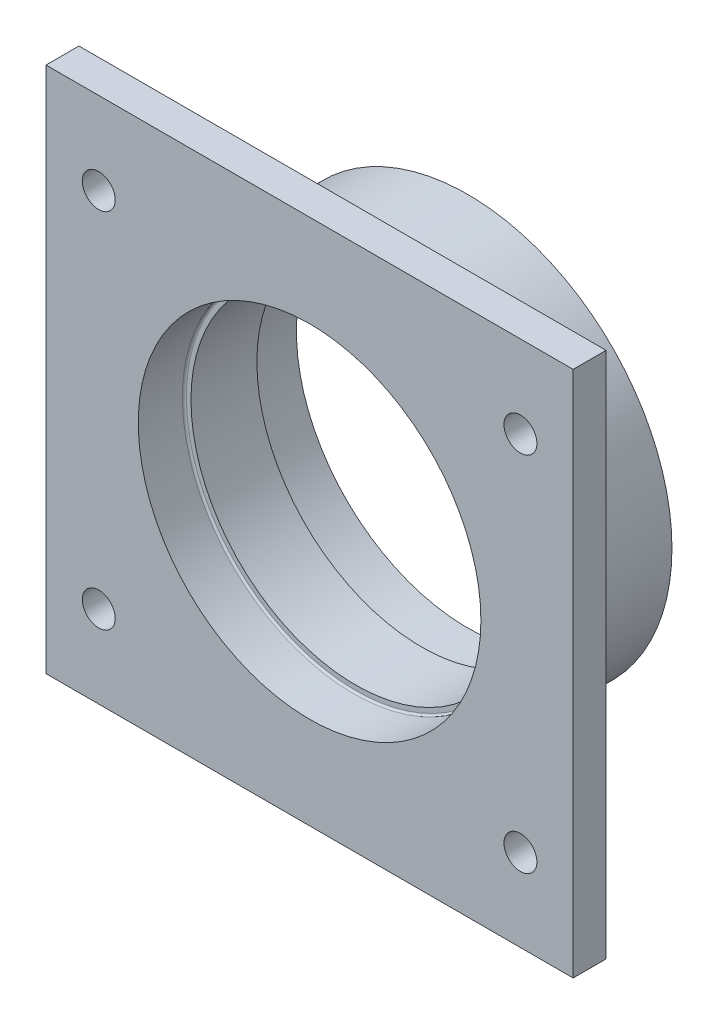
ISO-10303-21;
HEADER;
FILE_DESCRIPTION(('STEP AP214'),'2;1');
FILE_NAME('part.step','',(''),(''),'','','');
FILE_SCHEMA(('AUTOMOTIVE_DESIGN { 1 0 10303 214 1 1 1 1 }'));
ENDSEC;
DATA;
#1=APPLICATION_CONTEXT('core data for automotive mechanical design processes');
#2=APPLICATION_PROTOCOL_DEFINITION('international standard','automotive_design',2000,#1);
#3=PRODUCT_CONTEXT('',#1,'mechanical');
#4=PRODUCT('Part','Part','',(#3));
#5=PRODUCT_RELATED_PRODUCT_CATEGORY('part','',(#4));
#6=PRODUCT_DEFINITION_FORMATION('','',#4);
#7=PRODUCT_DEFINITION_CONTEXT('part definition',#1,'design');
#8=PRODUCT_DEFINITION('design','',#6,#7);
#9=PRODUCT_DEFINITION_SHAPE('','',#8);
#10=(LENGTH_UNIT() NAMED_UNIT(*) SI_UNIT(.MILLI.,.METRE.));
#11=(NAMED_UNIT(*) PLANE_ANGLE_UNIT() SI_UNIT($,.RADIAN.));
#12=(NAMED_UNIT(*) SI_UNIT($,.STERADIAN.) SOLID_ANGLE_UNIT());
#13=UNCERTAINTY_MEASURE_WITH_UNIT(LENGTH_MEASURE(1.E-05),#10,'distance_accuracy_value','');
#14=(GEOMETRIC_REPRESENTATION_CONTEXT(3) GLOBAL_UNCERTAINTY_ASSIGNED_CONTEXT((#13)) GLOBAL_UNIT_ASSIGNED_CONTEXT((#10,
#11,#12)) REPRESENTATION_CONTEXT('',''));
#15=CARTESIAN_POINT('',(0.,0.,0.));
#16=DIRECTION('',(0.,0.,1.));
#17=DIRECTION('',(1.,0.,0.));
#18=AXIS2_PLACEMENT_3D('',#15,#16,#17);
#19=CARTESIAN_POINT('',(0.,0.,17.));
#20=DIRECTION('',(0.,0.,1.));
#21=DIRECTION('',(1.,0.,0.));
#22=AXIS2_PLACEMENT_3D('',#19,#20,#21);
#23=PLANE('',#22);
#24=CARTESIAN_POINT('',(0.,0.,17.));
#25=DIRECTION('',(0.,0.,1.));
#26=DIRECTION('',(1.,0.,0.));
#27=AXIS2_PLACEMENT_3D('',#24,#25,#26);
#28=CIRCLE('',#27,25.7);
#29=CARTESIAN_POINT('',(25.7,0.,17.));
#30=VERTEX_POINT('',#29);
#31=EDGE_CURVE('E163',#30,#30,#28,.T.);
#32=ORIENTED_EDGE('',*,*,#31,.T.);
#33=EDGE_LOOP('',(#32));
#34=FACE_BOUND('',#33,.T.);
#35=CARTESIAN_POINT('',(0.,0.,17.));
#36=DIRECTION('',(0.,0.,1.));
#37=DIRECTION('',(1.,0.,0.));
#38=AXIS2_PLACEMENT_3D('',#35,#36,#37);
#39=CIRCLE('',#38,25.);
#40=CARTESIAN_POINT('',(25.,0.,17.));
#41=VERTEX_POINT('',#40);
#42=EDGE_CURVE('E140',#41,#41,#39,.T.);
#43=ORIENTED_EDGE('',*,*,#42,.F.);
#44=EDGE_LOOP('',(#43));
#45=FACE_BOUND('',#44,.T.);
#46=ADVANCED_FACE('F39',(#34,#45),#23,.T.);
#47=CARTESIAN_POINT('',(0.,0.,0.));
#48=DIRECTION('',(0.,0.,1.));
#49=DIRECTION('',(1.,0.,0.));
#50=AXIS2_PLACEMENT_3D('',#47,#48,#49);
#51=PLANE('',#50);
#52=CARTESIAN_POINT('',(0.,0.,0.));
#53=DIRECTION('',(0.,0.,1.));
#54=DIRECTION('',(1.,0.,0.));
#55=AXIS2_PLACEMENT_3D('',#52,#53,#54);
#56=CIRCLE('',#55,31.);
#57=CARTESIAN_POINT('',(31.,0.,0.));
#58=VERTEX_POINT('',#57);
#59=EDGE_CURVE('E151',#58,#58,#56,.T.);
#60=ORIENTED_EDGE('',*,*,#59,.F.);
#61=EDGE_LOOP('',(#60));
#62=FACE_BOUND('',#61,.T.);
#63=CARTESIAN_POINT('',(0.,0.,0.));
#64=DIRECTION('',(0.,0.,1.));
#65=DIRECTION('',(1.,0.,0.));
#66=AXIS2_PLACEMENT_3D('',#63,#64,#65);
#67=CIRCLE('',#66,26.);
#68=CARTESIAN_POINT('',(26.,0.,0.));
#69=VERTEX_POINT('',#68);
#70=EDGE_CURVE('E144',#69,#69,#67,.T.);
#71=ORIENTED_EDGE('',*,*,#70,.T.);
#72=EDGE_LOOP('',(#71));
#73=FACE_BOUND('',#72,.T.);
#74=ADVANCED_FACE('F231',(#62,#73),#51,.F.);
#75=CARTESIAN_POINT('',(0.,0.,7.));
#76=DIRECTION('',(0.,0.,-1.));
#77=DIRECTION('',(-1.,0.,0.));
#78=AXIS2_PLACEMENT_3D('',#75,#76,#77);
#79=CYLINDRICAL_SURFACE('',#78,31.);
#80=CARTESIAN_POINT('',(0.,0.,17.));
#81=DIRECTION('',(0.,0.,-1.));
#82=DIRECTION('',(-1.,0.,0.));
#83=AXIS2_PLACEMENT_3D('',#80,#81,#82);
#84=CIRCLE('',#83,31.);
#85=CARTESIAN_POINT('',(-31.,0.,17.));
#86=VERTEX_POINT('',#85);
#87=EDGE_CURVE('E11',#86,#86,#84,.T.);
#88=ORIENTED_EDGE('',*,*,#87,.T.);
#89=EDGE_LOOP('',(#88));
#90=FACE_BOUND('',#89,.T.);
#91=ORIENTED_EDGE('',*,*,#59,.T.);
#92=EDGE_LOOP('',(#91));
#93=FACE_BOUND('',#92,.T.);
#94=ADVANCED_FACE('F237',(#90,#93),#79,.T.);
#95=CARTESIAN_POINT('',(0.,0.,7.));
#96=DIRECTION('',(0.,0.,-1.));
#97=DIRECTION('',(-1.,0.,0.));
#98=AXIS2_PLACEMENT_3D('',#95,#96,#97);
#99=CYLINDRICAL_SURFACE('',#98,26.);
#100=CARTESIAN_POINT('',(0.,0.,6.7));
#101=DIRECTION('',(0.,0.,1.));
#102=DIRECTION('',(1.,0.,0.));
#103=AXIS2_PLACEMENT_3D('',#100,#101,#102);
#104=CIRCLE('',#103,26.);
#105=CARTESIAN_POINT('',(26.,0.,6.7));
#106=VERTEX_POINT('',#105);
#107=EDGE_CURVE('E155',#106,#106,#104,.T.);
#108=ORIENTED_EDGE('',*,*,#107,.T.);
#109=EDGE_LOOP('',(#108));
#110=FACE_BOUND('',#109,.T.);
#111=ORIENTED_EDGE('',*,*,#70,.F.);
#112=EDGE_LOOP('',(#111));
#113=FACE_BOUND('',#112,.T.);
#114=ADVANCED_FACE('F248',(#110,#113),#99,.F.);
#115=CARTESIAN_POINT('',(0.,0.,7.));
#116=DIRECTION('',(0.,0.,1.));
#117=DIRECTION('',(1.,0.,0.));
#118=AXIS2_PLACEMENT_3D('',#115,#116,#117);
#119=PLANE('',#118);
#120=CARTESIAN_POINT('',(0.,0.,7.));
#121=DIRECTION('',(0.,0.,1.));
#122=DIRECTION('',(1.,0.,0.));
#123=AXIS2_PLACEMENT_3D('',#120,#121,#122);
#124=CIRCLE('',#123,25.7);
#125=CARTESIAN_POINT('',(25.7,0.,7.));
#126=VERTEX_POINT('',#125);
#127=EDGE_CURVE('E159',#126,#126,#124,.F.);
#128=ORIENTED_EDGE('',*,*,#127,.T.);
#129=EDGE_LOOP('',(#128));
#130=FACE_BOUND('',#129,.T.);
#131=CARTESIAN_POINT('',(0.,0.,7.));
#132=DIRECTION('',(0.,0.,1.));
#133=DIRECTION('',(1.,0.,0.));
#134=AXIS2_PLACEMENT_3D('',#131,#132,#133);
#135=CIRCLE('',#134,25.);
#136=CARTESIAN_POINT('',(25.,0.,7.));
#137=VERTEX_POINT('',#136);
#138=EDGE_CURVE('E139',#137,#137,#135,.T.);
#139=ORIENTED_EDGE('',*,*,#138,.T.);
#140=EDGE_LOOP('',(#139));
#141=FACE_BOUND('',#140,.T.);
#142=ADVANCED_FACE('F245',(#130,#141),#119,.F.);
#143=CARTESIAN_POINT('',(0.,0.,17.));
#144=DIRECTION('',(0.,0.,-1.));
#145=DIRECTION('',(-1.,0.,0.));
#146=AXIS2_PLACEMENT_3D('',#143,#144,#145);
#147=CYLINDRICAL_SURFACE('',#146,25.);
#148=ORIENTED_EDGE('',*,*,#42,.T.);
#149=EDGE_LOOP('',(#148));
#150=FACE_BOUND('',#149,.T.);
#151=ORIENTED_EDGE('',*,*,#138,.F.);
#152=EDGE_LOOP('',(#151));
#153=FACE_BOUND('',#152,.T.);
#154=ADVANCED_FACE('F243',(#150,#153),#147,.F.);
#155=CARTESIAN_POINT('',(0.,0.,24.));
#156=DIRECTION('',(0.,0.,1.));
#157=DIRECTION('',(1.,0.,0.));
#158=AXIS2_PLACEMENT_3D('',#155,#156,#157);
#159=PLANE('',#158);
#160=CARTESIAN_POINT('',(-32.,27.5,24.));
#161=DIRECTION('',(0.,0.,1.));
#162=DIRECTION('',(1.,0.,0.));
#163=AXIS2_PLACEMENT_3D('',#160,#161,#162);
#164=CIRCLE('',#163,2.49999999999999);
#165=CARTESIAN_POINT('',(-29.5,27.5,24.));
#166=VERTEX_POINT('',#165);
#167=EDGE_CURVE('E199',#166,#166,#164,.T.);
#168=ORIENTED_EDGE('',*,*,#167,.F.);
#169=EDGE_LOOP('',(#168));
#170=FACE_BOUND('',#169,.T.);
#171=CARTESIAN_POINT('',(32.,27.5,24.));
#172=DIRECTION('',(0.,0.,1.));
#173=DIRECTION('',(1.,0.,0.));
#174=AXIS2_PLACEMENT_3D('',#171,#172,#173);
#175=CIRCLE('',#174,2.49999999999999);
#176=CARTESIAN_POINT('',(34.5,27.5,24.));
#177=VERTEX_POINT('',#176);
#178=EDGE_CURVE('E193',#177,#177,#175,.T.);
#179=ORIENTED_EDGE('',*,*,#178,.F.);
#180=EDGE_LOOP('',(#179));
#181=FACE_BOUND('',#180,.T.);
#182=CARTESIAN_POINT('',(32.,-27.5,24.));
#183=DIRECTION('',(0.,0.,1.));
#184=DIRECTION('',(1.,0.,0.));
#185=AXIS2_PLACEMENT_3D('',#182,#183,#184);
#186=CIRCLE('',#185,2.49999999999999);
#187=CARTESIAN_POINT('',(34.5,-27.5,24.));
#188=VERTEX_POINT('',#187);
#189=EDGE_CURVE('E180',#188,#188,#186,.T.);
#190=ORIENTED_EDGE('',*,*,#189,.F.);
#191=EDGE_LOOP('',(#190));
#192=FACE_BOUND('',#191,.T.);
#193=CARTESIAN_POINT('',(-32.,-27.5,24.));
#194=DIRECTION('',(0.,0.,1.));
#195=DIRECTION('',(1.,0.,0.));
#196=AXIS2_PLACEMENT_3D('',#193,#194,#195);
#197=CIRCLE('',#196,2.49999999999999);
#198=CARTESIAN_POINT('',(-29.5,-27.5,24.));
#199=VERTEX_POINT('',#198);
#200=EDGE_CURVE('E176',#199,#199,#197,.T.);
#201=ORIENTED_EDGE('',*,*,#200,.F.);
#202=EDGE_LOOP('',(#201));
#203=FACE_BOUND('',#202,.T.);
#204=CARTESIAN_POINT('',(0.,0.,24.));
#205=DIRECTION('',(0.,0.,1.));
#206=DIRECTION('',(1.,0.,0.));
#207=AXIS2_PLACEMENT_3D('',#204,#205,#206);
#208=CIRCLE('',#207,26.);
#209=CARTESIAN_POINT('',(26.,0.,24.));
#210=VERTEX_POINT('',#209);
#211=EDGE_CURVE('E131',#210,#210,#208,.T.);
#212=ORIENTED_EDGE('',*,*,#211,.F.);
#213=EDGE_LOOP('',(#212));
#214=FACE_BOUND('',#213,.T.);
#215=DIRECTION('',(0.,1.,0.));
#216=VECTOR('',#215,1.);
#217=CARTESIAN_POINT('',(40.,-40.,24.));
#218=LINE('',#217,#216);
#219=CARTESIAN_POINT('',(40.,-40.,24.));
#220=VERTEX_POINT('',#219);
#221=CARTESIAN_POINT('',(40.,40.,24.));
#222=VERTEX_POINT('',#221);
#223=EDGE_CURVE('E116',#220,#222,#218,.T.);
#224=ORIENTED_EDGE('',*,*,#223,.T.);
#225=DIRECTION('',(-1.,0.,0.));
#226=VECTOR('',#225,1.);
#227=CARTESIAN_POINT('',(-40.,40.,24.));
#228=LINE('',#227,#226);
#229=CARTESIAN_POINT('',(-40.,40.,24.));
#230=VERTEX_POINT('',#229);
#231=EDGE_CURVE('E120',#222,#230,#228,.T.);
#232=ORIENTED_EDGE('',*,*,#231,.T.);
#233=DIRECTION('',(0.,-1.,0.));
#234=VECTOR('',#233,1.);
#235=CARTESIAN_POINT('',(-40.,-40.,24.));
#236=LINE('',#235,#234);
#237=CARTESIAN_POINT('',(-40.,-40.,24.));
#238=VERTEX_POINT('',#237);
#239=EDGE_CURVE('E95',#230,#238,#236,.T.);
#240=ORIENTED_EDGE('',*,*,#239,.T.);
#241=DIRECTION('',(1.,0.,0.));
#242=VECTOR('',#241,1.);
#243=CARTESIAN_POINT('',(-40.,-40.,24.));
#244=LINE('',#243,#242);
#245=EDGE_CURVE('E110',#238,#220,#244,.T.);
#246=ORIENTED_EDGE('',*,*,#245,.T.);
#247=EDGE_LOOP('',(#224,#232,#240,#246));
#248=FACE_BOUND('',#247,.T.);
#249=ADVANCED_FACE('F276',(#170,#181,#192,#203,#214,#248),#159,.T.);
#250=CARTESIAN_POINT('',(0.,0.,24.));
#251=DIRECTION('',(0.,0.,-1.));
#252=DIRECTION('',(-1.,0.,0.));
#253=AXIS2_PLACEMENT_3D('',#250,#251,#252);
#254=CYLINDRICAL_SURFACE('',#253,26.);
#255=CARTESIAN_POINT('',(0.,0.,17.3));
#256=DIRECTION('',(0.,0.,1.));
#257=DIRECTION('',(1.,0.,0.));
#258=AXIS2_PLACEMENT_3D('',#255,#256,#257);
#259=CIRCLE('',#258,26.);
#260=CARTESIAN_POINT('',(26.,0.,17.3));
#261=VERTEX_POINT('',#260);
#262=EDGE_CURVE('E167',#261,#261,#259,.F.);
#263=ORIENTED_EDGE('',*,*,#262,.T.);
#264=EDGE_LOOP('',(#263));
#265=FACE_BOUND('',#264,.T.);
#266=ORIENTED_EDGE('',*,*,#211,.T.);
#267=EDGE_LOOP('',(#266));
#268=FACE_BOUND('',#267,.T.);
#269=ADVANCED_FACE('F259',(#265,#268),#254,.F.);
#270=CARTESIAN_POINT('',(0.,0.,6.7));
#271=DIRECTION('',(0.,0.,1.));
#272=DIRECTION('',(1.,0.,0.));
#273=AXIS2_PLACEMENT_3D('',#270,#271,#272);
#274=TOROIDAL_SURFACE('',#273,25.7,0.3);
#275=ORIENTED_EDGE('',*,*,#127,.F.);
#276=EDGE_LOOP('',(#275));
#277=FACE_BOUND('',#276,.T.);
#278=ORIENTED_EDGE('',*,*,#107,.F.);
#279=EDGE_LOOP('',(#278));
#280=FACE_BOUND('',#279,.T.);
#281=ADVANCED_FACE('F256',(#277,#280),#274,.F.);
#282=CARTESIAN_POINT('',(0.,0.,17.3));
#283=DIRECTION('',(0.,0.,1.));
#284=DIRECTION('',(1.,0.,0.));
#285=AXIS2_PLACEMENT_3D('',#282,#283,#284);
#286=TOROIDAL_SURFACE('',#285,25.7,0.3);
#287=ORIENTED_EDGE('',*,*,#262,.F.);
#288=EDGE_LOOP('',(#287));
#289=FACE_BOUND('',#288,.T.);
#290=ORIENTED_EDGE('',*,*,#31,.F.);
#291=EDGE_LOOP('',(#290));
#292=FACE_BOUND('',#291,.T.);
#293=ADVANCED_FACE('F258',(#289,#292),#286,.F.);
#294=CARTESIAN_POINT('',(40.,-40.,19.));
#295=DIRECTION('',(1.,0.,0.));
#296=DIRECTION('',(0.,0.,-1.));
#297=AXIS2_PLACEMENT_3D('',#294,#295,#296);
#298=PLANE('',#297);
#299=ORIENTED_EDGE('',*,*,#223,.F.);
#300=DIRECTION('',(0.,0.,1.));
#301=VECTOR('',#300,1.);
#302=CARTESIAN_POINT('',(40.,-40.,19.));
#303=LINE('',#302,#301);
#304=CARTESIAN_POINT('',(40.,-40.,19.));
#305=VERTEX_POINT('',#304);
#306=EDGE_CURVE('E59',#305,#220,#303,.T.);
#307=ORIENTED_EDGE('',*,*,#306,.F.);
#308=DIRECTION('',(0.,1.,0.));
#309=VECTOR('',#308,1.);
#310=CARTESIAN_POINT('',(40.,-40.,19.));
#311=LINE('',#310,#309);
#312=CARTESIAN_POINT('',(40.,40.,19.));
#313=VERTEX_POINT('',#312);
#314=EDGE_CURVE('E107',#305,#313,#311,.T.);
#315=ORIENTED_EDGE('',*,*,#314,.T.);
#316=DIRECTION('',(0.,0.,1.));
#317=VECTOR('',#316,1.);
#318=CARTESIAN_POINT('',(40.,40.,19.));
#319=LINE('',#318,#317);
#320=EDGE_CURVE('E87',#313,#222,#319,.T.);
#321=ORIENTED_EDGE('',*,*,#320,.T.);
#322=EDGE_LOOP('',(#299,#307,#315,#321));
#323=FACE_BOUND('',#322,.T.);
#324=ADVANCED_FACE('F262',(#323),#298,.T.);
#325=CARTESIAN_POINT('',(-40.,-40.,19.));
#326=DIRECTION('',(0.,-1.,0.));
#327=DIRECTION('',(0.,0.,-1.));
#328=AXIS2_PLACEMENT_3D('',#325,#326,#327);
#329=PLANE('',#328);
#330=ORIENTED_EDGE('',*,*,#245,.F.);
#331=DIRECTION('',(0.,0.,1.));
#332=VECTOR('',#331,1.);
#333=CARTESIAN_POINT('',(-40.,-40.,19.));
#334=LINE('',#333,#332);
#335=CARTESIAN_POINT('',(-40.,-40.,19.));
#336=VERTEX_POINT('',#335);
#337=EDGE_CURVE('E76',#336,#238,#334,.T.);
#338=ORIENTED_EDGE('',*,*,#337,.F.);
#339=DIRECTION('',(1.,0.,0.));
#340=VECTOR('',#339,1.);
#341=CARTESIAN_POINT('',(-40.,-40.,19.));
#342=LINE('',#341,#340);
#343=EDGE_CURVE('E102',#336,#305,#342,.T.);
#344=ORIENTED_EDGE('',*,*,#343,.T.);
#345=ORIENTED_EDGE('',*,*,#306,.T.);
#346=EDGE_LOOP('',(#330,#338,#344,#345));
#347=FACE_BOUND('',#346,.T.);
#348=ADVANCED_FACE('F268',(#347),#329,.T.);
#349=CARTESIAN_POINT('',(-40.,-40.,19.));
#350=DIRECTION('',(-1.,0.,0.));
#351=DIRECTION('',(0.,0.,1.));
#352=AXIS2_PLACEMENT_3D('',#349,#350,#351);
#353=PLANE('',#352);
#354=ORIENTED_EDGE('',*,*,#239,.F.);
#355=DIRECTION('',(0.,0.,1.));
#356=VECTOR('',#355,1.);
#357=CARTESIAN_POINT('',(-40.,40.,19.));
#358=LINE('',#357,#356);
#359=CARTESIAN_POINT('',(-40.,40.,19.));
#360=VERTEX_POINT('',#359);
#361=EDGE_CURVE('E90',#360,#230,#358,.T.);
#362=ORIENTED_EDGE('',*,*,#361,.F.);
#363=DIRECTION('',(0.,-1.,0.));
#364=VECTOR('',#363,1.);
#365=CARTESIAN_POINT('',(-40.,-40.,19.));
#366=LINE('',#365,#364);
#367=EDGE_CURVE('E93',#360,#336,#366,.T.);
#368=ORIENTED_EDGE('',*,*,#367,.T.);
#369=ORIENTED_EDGE('',*,*,#337,.T.);
#370=EDGE_LOOP('',(#354,#362,#368,#369));
#371=FACE_BOUND('',#370,.T.);
#372=ADVANCED_FACE('F92',(#371),#353,.T.);
#373=CARTESIAN_POINT('',(-40.,40.,19.));
#374=DIRECTION('',(0.,1.,0.));
#375=DIRECTION('',(0.,0.,1.));
#376=AXIS2_PLACEMENT_3D('',#373,#374,#375);
#377=PLANE('',#376);
#378=ORIENTED_EDGE('',*,*,#231,.F.);
#379=ORIENTED_EDGE('',*,*,#320,.F.);
#380=DIRECTION('',(-1.,0.,0.));
#381=VECTOR('',#380,1.);
#382=CARTESIAN_POINT('',(-40.,40.,19.));
#383=LINE('',#382,#381);
#384=EDGE_CURVE('E101',#313,#360,#383,.T.);
#385=ORIENTED_EDGE('',*,*,#384,.T.);
#386=ORIENTED_EDGE('',*,*,#361,.T.);
#387=EDGE_LOOP('',(#378,#379,#385,#386));
#388=FACE_BOUND('',#387,.T.);
#389=ADVANCED_FACE('F105',(#388),#377,.T.);
#390=CARTESIAN_POINT('',(0.,0.,19.));
#391=DIRECTION('',(0.,0.,-1.));
#392=DIRECTION('',(-1.,0.,0.));
#393=AXIS2_PLACEMENT_3D('',#390,#391,#392);
#394=PLANE('',#393);
#395=CARTESIAN_POINT('',(-32.,27.5,19.));
#396=DIRECTION('',(0.,0.,-1.));
#397=DIRECTION('',(-1.,0.,0.));
#398=AXIS2_PLACEMENT_3D('',#395,#396,#397);
#399=CIRCLE('',#398,2.49999999999999);
#400=CARTESIAN_POINT('',(-34.5,27.5,19.));
#401=VERTEX_POINT('',#400);
#402=EDGE_CURVE('E43',#401,#401,#399,.T.);
#403=ORIENTED_EDGE('',*,*,#402,.F.);
#404=EDGE_LOOP('',(#403));
#405=FACE_BOUND('',#404,.T.);
#406=CARTESIAN_POINT('',(32.,27.5,19.));
#407=DIRECTION('',(0.,0.,-1.));
#408=DIRECTION('',(-1.,0.,0.));
#409=AXIS2_PLACEMENT_3D('',#406,#407,#408);
#410=CIRCLE('',#409,2.49999999999999);
#411=CARTESIAN_POINT('',(29.5,27.5,19.));
#412=VERTEX_POINT('',#411);
#413=EDGE_CURVE('E187',#412,#412,#410,.T.);
#414=ORIENTED_EDGE('',*,*,#413,.F.);
#415=EDGE_LOOP('',(#414));
#416=FACE_BOUND('',#415,.T.);
#417=CARTESIAN_POINT('',(32.,-27.5,19.));
#418=DIRECTION('',(0.,0.,-1.));
#419=DIRECTION('',(-1.,0.,0.));
#420=AXIS2_PLACEMENT_3D('',#417,#418,#419);
#421=CIRCLE('',#420,2.49999999999999);
#422=CARTESIAN_POINT('',(29.5,-27.5,19.));
#423=VERTEX_POINT('',#422);
#424=EDGE_CURVE('E177',#423,#423,#421,.T.);
#425=ORIENTED_EDGE('',*,*,#424,.F.);
#426=EDGE_LOOP('',(#425));
#427=FACE_BOUND('',#426,.T.);
#428=CARTESIAN_POINT('',(-32.,-27.5,19.));
#429=DIRECTION('',(0.,0.,-1.));
#430=DIRECTION('',(-1.,0.,0.));
#431=AXIS2_PLACEMENT_3D('',#428,#429,#430);
#432=CIRCLE('',#431,2.49999999999999);
#433=CARTESIAN_POINT('',(-34.5,-27.5,19.));
#434=VERTEX_POINT('',#433);
#435=EDGE_CURVE('E121',#434,#434,#432,.T.);
#436=ORIENTED_EDGE('',*,*,#435,.F.);
#437=EDGE_LOOP('',(#436));
#438=FACE_BOUND('',#437,.T.);
#439=CARTESIAN_POINT('',(0.,0.,19.));
#440=DIRECTION('',(0.,0.,-1.));
#441=DIRECTION('',(-1.,0.,0.));
#442=AXIS2_PLACEMENT_3D('',#439,#440,#441);
#443=CIRCLE('',#442,33.);
#444=CARTESIAN_POINT('',(-33.,0.,19.));
#445=VERTEX_POINT('',#444);
#446=EDGE_CURVE('E50',#445,#445,#443,.F.);
#447=ORIENTED_EDGE('',*,*,#446,.T.);
#448=EDGE_LOOP('',(#447));
#449=FACE_BOUND('',#448,.T.);
#450=ORIENTED_EDGE('',*,*,#314,.F.);
#451=ORIENTED_EDGE('',*,*,#343,.F.);
#452=ORIENTED_EDGE('',*,*,#367,.F.);
#453=ORIENTED_EDGE('',*,*,#384,.F.);
#454=EDGE_LOOP('',(#450,#451,#452,#453));
#455=FACE_BOUND('',#454,.T.);
#456=ADVANCED_FACE('F100',(#405,#416,#427,#438,#449,#455),#394,.T.);
#457=CARTESIAN_POINT('',(0.,0.,17.));
#458=DIRECTION('',(0.,0.,-1.));
#459=DIRECTION('',(-1.,0.,0.));
#460=AXIS2_PLACEMENT_3D('',#457,#458,#459);
#461=TOROIDAL_SURFACE('',#460,33.,2.);
#462=ORIENTED_EDGE('',*,*,#87,.F.);
#463=EDGE_LOOP('',(#462));
#464=FACE_BOUND('',#463,.T.);
#465=ORIENTED_EDGE('',*,*,#446,.F.);
#466=EDGE_LOOP('',(#465));
#467=FACE_BOUND('',#466,.T.);
#468=ADVANCED_FACE('F41',(#464,#467),#461,.F.);
#469=CARTESIAN_POINT('',(-32.,-27.5,24.));
#470=DIRECTION('',(0.,0.,1.));
#471=DIRECTION('',(1.,0.,0.));
#472=AXIS2_PLACEMENT_3D('',#469,#470,#471);
#473=CYLINDRICAL_SURFACE('',#472,2.49999999999999);
#474=ORIENTED_EDGE('',*,*,#435,.T.);
#475=EDGE_LOOP('',(#474));
#476=FACE_BOUND('',#475,.T.);
#477=ORIENTED_EDGE('',*,*,#200,.T.);
#478=EDGE_LOOP('',(#477));
#479=FACE_BOUND('',#478,.T.);
#480=ADVANCED_FACE('F221',(#476,#479),#473,.F.);
#481=CARTESIAN_POINT('',(32.,-27.5,24.));
#482=DIRECTION('',(0.,0.,1.));
#483=DIRECTION('',(1.,0.,0.));
#484=AXIS2_PLACEMENT_3D('',#481,#482,#483);
#485=CYLINDRICAL_SURFACE('',#484,2.49999999999999);
#486=ORIENTED_EDGE('',*,*,#424,.T.);
#487=EDGE_LOOP('',(#486));
#488=FACE_BOUND('',#487,.T.);
#489=ORIENTED_EDGE('',*,*,#189,.T.);
#490=EDGE_LOOP('',(#489));
#491=FACE_BOUND('',#490,.T.);
#492=ADVANCED_FACE('F226',(#488,#491),#485,.F.);
#493=CARTESIAN_POINT('',(32.,27.5,24.));
#494=DIRECTION('',(0.,0.,1.));
#495=DIRECTION('',(1.,0.,0.));
#496=AXIS2_PLACEMENT_3D('',#493,#494,#495);
#497=CYLINDRICAL_SURFACE('',#496,2.49999999999999);
#498=ORIENTED_EDGE('',*,*,#413,.T.);
#499=EDGE_LOOP('',(#498));
#500=FACE_BOUND('',#499,.T.);
#501=ORIENTED_EDGE('',*,*,#178,.T.);
#502=EDGE_LOOP('',(#501));
#503=FACE_BOUND('',#502,.T.);
#504=ADVANCED_FACE('F317',(#500,#503),#497,.F.);
#505=CARTESIAN_POINT('',(-32.,27.5,24.));
#506=DIRECTION('',(0.,0.,1.));
#507=DIRECTION('',(1.,0.,0.));
#508=AXIS2_PLACEMENT_3D('',#505,#506,#507);
#509=CYLINDRICAL_SURFACE('',#508,2.49999999999999);
#510=ORIENTED_EDGE('',*,*,#402,.T.);
#511=EDGE_LOOP('',(#510));
#512=FACE_BOUND('',#511,.T.);
#513=ORIENTED_EDGE('',*,*,#167,.T.);
#514=EDGE_LOOP('',(#513));
#515=FACE_BOUND('',#514,.T.);
#516=ADVANCED_FACE('F208',(#512,#515),#509,.F.);
#517=CLOSED_SHELL('',(#46,#74,#94,#114,#142,#154,#249,#269,#281,#293,#324,#348,#372,#389,#456,
#468,#480,#492,#504,#516));
#518=MANIFOLD_SOLID_BREP('B2',#517);
#519=ADVANCED_BREP_SHAPE_REPRESENTATION('',(#18,#518),#14);
#520=SHAPE_DEFINITION_REPRESENTATION(#9,#519);
ENDSEC;
END-ISO-10303-21;
